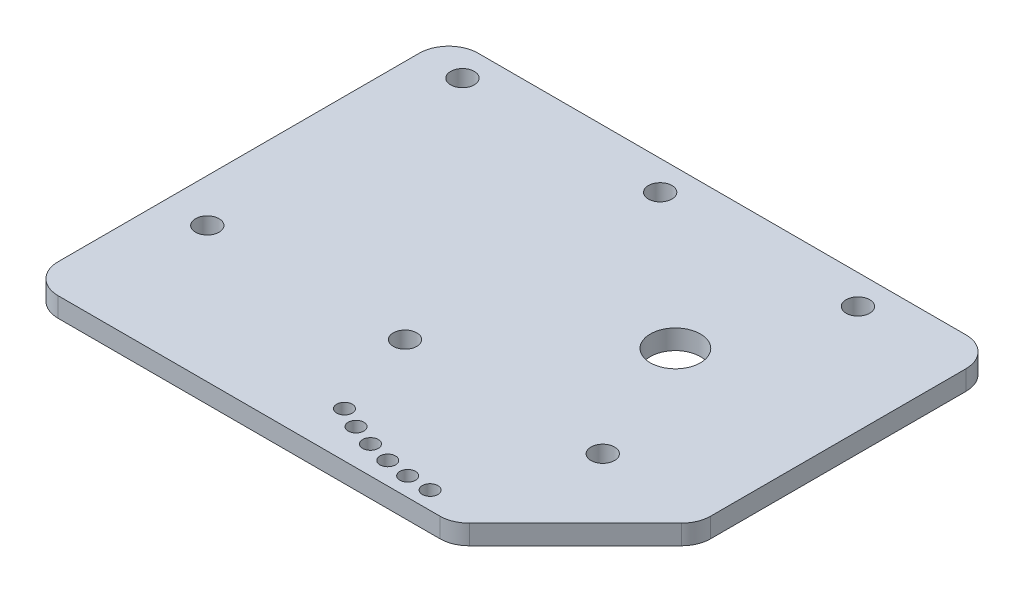
ISO-10303-21;
HEADER;
FILE_DESCRIPTION(('STEP AP214'),'2;1');
FILE_NAME('part.step','',(''),(''),'','','');
FILE_SCHEMA(('AUTOMOTIVE_DESIGN { 1 0 10303 214 1 1 1 1 }'));
ENDSEC;
DATA;
#1=APPLICATION_CONTEXT('core data for automotive mechanical design processes');
#2=APPLICATION_PROTOCOL_DEFINITION('international standard','automotive_design',2000,#1);
#3=PRODUCT_CONTEXT('',#1,'mechanical');
#4=PRODUCT('Part','Part','',(#3));
#5=PRODUCT_RELATED_PRODUCT_CATEGORY('part','',(#4));
#6=PRODUCT_DEFINITION_FORMATION('','',#4);
#7=PRODUCT_DEFINITION_CONTEXT('part definition',#1,'design');
#8=PRODUCT_DEFINITION('design','',#6,#7);
#9=PRODUCT_DEFINITION_SHAPE('','',#8);
#10=(LENGTH_UNIT() NAMED_UNIT(*) SI_UNIT(.MILLI.,.METRE.));
#11=(NAMED_UNIT(*) PLANE_ANGLE_UNIT() SI_UNIT($,.RADIAN.));
#12=(NAMED_UNIT(*) SI_UNIT($,.STERADIAN.) SOLID_ANGLE_UNIT());
#13=UNCERTAINTY_MEASURE_WITH_UNIT(LENGTH_MEASURE(1.E-05),#10,'distance_accuracy_value','');
#14=(GEOMETRIC_REPRESENTATION_CONTEXT(3) GLOBAL_UNCERTAINTY_ASSIGNED_CONTEXT((#13)) GLOBAL_UNIT_ASSIGNED_CONTEXT((#10,
#11,#12)) REPRESENTATION_CONTEXT('',''));
#15=CARTESIAN_POINT('',(0.,0.,0.));
#16=DIRECTION('',(0.,0.,1.));
#17=DIRECTION('',(1.,0.,0.));
#18=AXIS2_PLACEMENT_3D('',#15,#16,#17);
#19=CARTESIAN_POINT('',(-180.5,10.,119.));
#20=DIRECTION('',(0.,-1.,0.));
#21=DIRECTION('',(0.,0.,-1.));
#22=AXIS2_PLACEMENT_3D('',#19,#20,#21);
#23=CYLINDRICAL_SURFACE('',#22,15.);
#24=CARTESIAN_POINT('',(-180.5,0.,119.));
#25=DIRECTION('',(0.,1.,0.));
#26=DIRECTION('',(0.,0.,1.));
#27=AXIS2_PLACEMENT_3D('',#24,#25,#26);
#28=CIRCLE('',#27,15.);
#29=CARTESIAN_POINT('',(-195.5,0.,119.));
#30=VERTEX_POINT('',#29);
#31=CARTESIAN_POINT('',(-180.5,0.,134.));
#32=VERTEX_POINT('',#31);
#33=EDGE_CURVE('E144',#30,#32,#28,.T.);
#34=ORIENTED_EDGE('',*,*,#33,.T.);
#35=DIRECTION('',(0.,-1.,0.));
#36=VECTOR('',#35,1.);
#37=CARTESIAN_POINT('',(-180.5,10.,134.));
#38=LINE('',#37,#36);
#39=CARTESIAN_POINT('',(-180.5,10.,134.));
#40=VERTEX_POINT('',#39);
#41=EDGE_CURVE('E11',#40,#32,#38,.T.);
#42=ORIENTED_EDGE('',*,*,#41,.F.);
#43=CARTESIAN_POINT('',(-180.5,10.,119.));
#44=DIRECTION('',(0.,1.,0.));
#45=DIRECTION('',(0.,0.,1.));
#46=AXIS2_PLACEMENT_3D('',#43,#44,#45);
#47=CIRCLE('',#46,15.);
#48=CARTESIAN_POINT('',(-195.5,10.,119.));
#49=VERTEX_POINT('',#48);
#50=EDGE_CURVE('E163',#49,#40,#47,.T.);
#51=ORIENTED_EDGE('',*,*,#50,.F.);
#52=DIRECTION('',(0.,-1.,0.));
#53=VECTOR('',#52,1.);
#54=CARTESIAN_POINT('',(-195.5,10.,119.));
#55=LINE('',#54,#53);
#56=EDGE_CURVE('E140',#49,#30,#55,.T.);
#57=ORIENTED_EDGE('',*,*,#56,.T.);
#58=EDGE_LOOP('',(#34,#42,#51,#57));
#59=FACE_BOUND('',#58,.T.);
#60=ADVANCED_FACE('F36',(#59),#23,.T.);
#61=CARTESIAN_POINT('',(-180.5,10.,134.));
#62=DIRECTION('',(0.,0.,-1.));
#63=DIRECTION('',(-1.,0.,0.));
#64=AXIS2_PLACEMENT_3D('',#61,#62,#63);
#65=PLANE('',#64);
#66=DIRECTION('',(1.,0.,0.));
#67=VECTOR('',#66,1.);
#68=CARTESIAN_POINT('',(-180.5,0.,134.));
#69=LINE('',#68,#67);
#70=CARTESIAN_POINT('',(13.9999999999998,0.,134.));
#71=VERTEX_POINT('',#70);
#72=EDGE_CURVE('E147',#32,#71,#69,.T.);
#73=ORIENTED_EDGE('',*,*,#72,.T.);
#74=DIRECTION('',(0.,-1.,0.));
#75=VECTOR('',#74,1.);
#76=CARTESIAN_POINT('',(13.9999999999998,10.,134.));
#77=LINE('',#76,#75);
#78=CARTESIAN_POINT('',(13.9999999999998,10.,134.));
#79=VERTEX_POINT('',#78);
#80=EDGE_CURVE('E44',#79,#71,#77,.T.);
#81=ORIENTED_EDGE('',*,*,#80,.F.);
#82=DIRECTION('',(1.,0.,0.));
#83=VECTOR('',#82,1.);
#84=CARTESIAN_POINT('',(-180.5,10.,134.));
#85=LINE('',#84,#83);
#86=EDGE_CURVE('E101',#40,#79,#85,.T.);
#87=ORIENTED_EDGE('',*,*,#86,.F.);
#88=ORIENTED_EDGE('',*,*,#41,.T.);
#89=EDGE_LOOP('',(#73,#81,#87,#88));
#90=FACE_BOUND('',#89,.T.);
#91=ADVANCED_FACE('F334',(#90),#65,.F.);
#92=CARTESIAN_POINT('',(13.9999999999998,10.,119.));
#93=DIRECTION('',(0.,-1.,0.));
#94=DIRECTION('',(0.,0.,-1.));
#95=AXIS2_PLACEMENT_3D('',#92,#93,#94);
#96=CYLINDRICAL_SURFACE('',#95,15.);
#97=CARTESIAN_POINT('',(13.9999999999998,0.,119.));
#98=DIRECTION('',(0.,1.,0.));
#99=DIRECTION('',(0.,0.,1.));
#100=AXIS2_PLACEMENT_3D('',#97,#98,#99);
#101=CIRCLE('',#100,15.);
#102=CARTESIAN_POINT('',(24.606601717798,0.,129.606601717798));
#103=VERTEX_POINT('',#102);
#104=EDGE_CURVE('E150',#71,#103,#101,.T.);
#105=ORIENTED_EDGE('',*,*,#104,.T.);
#106=DIRECTION('',(0.,-1.,0.));
#107=VECTOR('',#106,1.);
#108=CARTESIAN_POINT('',(24.606601717798,10.,129.606601717798));
#109=LINE('',#108,#107);
#110=CARTESIAN_POINT('',(24.606601717798,10.,129.606601717798));
#111=VERTEX_POINT('',#110);
#112=EDGE_CURVE('E176',#111,#103,#109,.T.);
#113=ORIENTED_EDGE('',*,*,#112,.F.);
#114=CARTESIAN_POINT('',(13.9999999999998,10.,119.));
#115=DIRECTION('',(0.,1.,0.));
#116=DIRECTION('',(0.,0.,1.));
#117=AXIS2_PLACEMENT_3D('',#114,#115,#116);
#118=CIRCLE('',#117,15.);
#119=EDGE_CURVE('E184',#79,#111,#118,.T.);
#120=ORIENTED_EDGE('',*,*,#119,.F.);
#121=ORIENTED_EDGE('',*,*,#80,.T.);
#122=EDGE_LOOP('',(#105,#113,#120,#121));
#123=FACE_BOUND('',#122,.T.);
#124=ADVANCED_FACE('F182',(#123),#96,.T.);
#125=CARTESIAN_POINT('',(24.606601717798,10.,129.606601717798));
#126=DIRECTION('',(-0.707106781186546,0.,-0.707106781186549));
#127=DIRECTION('',(-0.707106781186549,0.,0.707106781186546));
#128=AXIS2_PLACEMENT_3D('',#125,#126,#127);
#129=PLANE('',#128);
#130=DIRECTION('',(0.707106781186549,0.,-0.707106781186546));
#131=VECTOR('',#130,1.);
#132=CARTESIAN_POINT('',(24.606601717798,0.,129.606601717798));
#133=LINE('',#132,#131);
#134=CARTESIAN_POINT('',(78.6066017177982,0.,75.6066017177982));
#135=VERTEX_POINT('',#134);
#136=EDGE_CURVE('E152',#103,#135,#133,.T.);
#137=ORIENTED_EDGE('',*,*,#136,.T.);
#138=DIRECTION('',(0.,-1.,0.));
#139=VECTOR('',#138,1.);
#140=CARTESIAN_POINT('',(78.6066017177982,10.,75.6066017177982));
#141=LINE('',#140,#139);
#142=CARTESIAN_POINT('',(78.6066017177982,10.,75.6066017177982));
#143=VERTEX_POINT('',#142);
#144=EDGE_CURVE('E173',#143,#135,#141,.T.);
#145=ORIENTED_EDGE('',*,*,#144,.F.);
#146=DIRECTION('',(0.707106781186549,0.,-0.707106781186546));
#147=VECTOR('',#146,1.);
#148=CARTESIAN_POINT('',(24.606601717798,10.,129.606601717798));
#149=LINE('',#148,#147);
#150=EDGE_CURVE('E202',#111,#143,#149,.T.);
#151=ORIENTED_EDGE('',*,*,#150,.F.);
#152=ORIENTED_EDGE('',*,*,#112,.T.);
#153=EDGE_LOOP('',(#137,#145,#151,#152));
#154=FACE_BOUND('',#153,.T.);
#155=ADVANCED_FACE('F193',(#154),#129,.F.);
#156=CARTESIAN_POINT('',(68.,10.,65.));
#157=DIRECTION('',(0.,-1.,0.));
#158=DIRECTION('',(0.,0.,-1.));
#159=AXIS2_PLACEMENT_3D('',#156,#157,#158);
#160=CYLINDRICAL_SURFACE('',#159,15.);
#161=CARTESIAN_POINT('',(68.,0.,65.));
#162=DIRECTION('',(0.,1.,0.));
#163=DIRECTION('',(0.,0.,1.));
#164=AXIS2_PLACEMENT_3D('',#161,#162,#163);
#165=CIRCLE('',#164,15.);
#166=CARTESIAN_POINT('',(83.,0.,65.));
#167=VERTEX_POINT('',#166);
#168=EDGE_CURVE('E154',#135,#167,#165,.T.);
#169=ORIENTED_EDGE('',*,*,#168,.T.);
#170=DIRECTION('',(0.,-1.,0.));
#171=VECTOR('',#170,1.);
#172=CARTESIAN_POINT('',(83.,10.,65.));
#173=LINE('',#172,#171);
#174=CARTESIAN_POINT('',(83.,10.,65.));
#175=VERTEX_POINT('',#174);
#176=EDGE_CURVE('E170',#175,#167,#173,.T.);
#177=ORIENTED_EDGE('',*,*,#176,.F.);
#178=CARTESIAN_POINT('',(68.,10.,65.));
#179=DIRECTION('',(0.,1.,0.));
#180=DIRECTION('',(0.,0.,1.));
#181=AXIS2_PLACEMENT_3D('',#178,#179,#180);
#182=CIRCLE('',#181,15.);
#183=EDGE_CURVE('E199',#143,#175,#182,.T.);
#184=ORIENTED_EDGE('',*,*,#183,.F.);
#185=ORIENTED_EDGE('',*,*,#144,.T.);
#186=EDGE_LOOP('',(#169,#177,#184,#185));
#187=FACE_BOUND('',#186,.T.);
#188=ADVANCED_FACE('F197',(#187),#160,.T.);
#189=CARTESIAN_POINT('',(83.,10.,65.));
#190=DIRECTION('',(-1.,0.,0.));
#191=DIRECTION('',(0.,0.,1.));
#192=AXIS2_PLACEMENT_3D('',#189,#190,#191);
#193=PLANE('',#192);
#194=DIRECTION('',(0.,0.,-1.));
#195=VECTOR('',#194,1.);
#196=CARTESIAN_POINT('',(83.,0.,65.));
#197=LINE('',#196,#195);
#198=CARTESIAN_POINT('',(83.,0.,-65.));
#199=VERTEX_POINT('',#198);
#200=EDGE_CURVE('E156',#167,#199,#197,.T.);
#201=ORIENTED_EDGE('',*,*,#200,.T.);
#202=DIRECTION('',(0.,-1.,0.));
#203=VECTOR('',#202,1.);
#204=CARTESIAN_POINT('',(83.,10.,-65.));
#205=LINE('',#204,#203);
#206=CARTESIAN_POINT('',(83.,10.,-65.));
#207=VERTEX_POINT('',#206);
#208=EDGE_CURVE('E167',#207,#199,#205,.T.);
#209=ORIENTED_EDGE('',*,*,#208,.F.);
#210=DIRECTION('',(0.,0.,-1.));
#211=VECTOR('',#210,1.);
#212=CARTESIAN_POINT('',(83.,10.,65.));
#213=LINE('',#212,#211);
#214=EDGE_CURVE('E201',#175,#207,#213,.T.);
#215=ORIENTED_EDGE('',*,*,#214,.F.);
#216=ORIENTED_EDGE('',*,*,#176,.T.);
#217=EDGE_LOOP('',(#201,#209,#215,#216));
#218=FACE_BOUND('',#217,.T.);
#219=ADVANCED_FACE('F346',(#218),#193,.F.);
#220=CARTESIAN_POINT('',(68.,10.,-65.));
#221=DIRECTION('',(0.,-1.,0.));
#222=DIRECTION('',(0.,0.,-1.));
#223=AXIS2_PLACEMENT_3D('',#220,#221,#222);
#224=CYLINDRICAL_SURFACE('',#223,15.);
#225=CARTESIAN_POINT('',(68.,0.,-65.));
#226=DIRECTION('',(0.,1.,0.));
#227=DIRECTION('',(0.,0.,1.));
#228=AXIS2_PLACEMENT_3D('',#225,#226,#227);
#229=CIRCLE('',#228,15.);
#230=CARTESIAN_POINT('',(68.,0.,-80.));
#231=VERTEX_POINT('',#230);
#232=EDGE_CURVE('E158',#199,#231,#229,.T.);
#233=ORIENTED_EDGE('',*,*,#232,.T.);
#234=DIRECTION('',(0.,-1.,0.));
#235=VECTOR('',#234,1.);
#236=CARTESIAN_POINT('',(68.,10.,-80.));
#237=LINE('',#236,#235);
#238=CARTESIAN_POINT('',(68.,10.,-80.));
#239=VERTEX_POINT('',#238);
#240=EDGE_CURVE('E135',#239,#231,#237,.T.);
#241=ORIENTED_EDGE('',*,*,#240,.F.);
#242=CARTESIAN_POINT('',(68.,10.,-65.));
#243=DIRECTION('',(0.,1.,0.));
#244=DIRECTION('',(0.,0.,1.));
#245=AXIS2_PLACEMENT_3D('',#242,#243,#244);
#246=CIRCLE('',#245,15.);
#247=EDGE_CURVE('E126',#207,#239,#246,.T.);
#248=ORIENTED_EDGE('',*,*,#247,.F.);
#249=ORIENTED_EDGE('',*,*,#208,.T.);
#250=EDGE_LOOP('',(#233,#241,#248,#249));
#251=FACE_BOUND('',#250,.T.);
#252=ADVANCED_FACE('F343',(#251),#224,.T.);
#253=CARTESIAN_POINT('',(68.,10.,-80.));
#254=DIRECTION('',(0.,0.,1.));
#255=DIRECTION('',(1.,0.,0.));
#256=AXIS2_PLACEMENT_3D('',#253,#254,#255);
#257=PLANE('',#256);
#258=DIRECTION('',(-1.,0.,0.));
#259=VECTOR('',#258,1.);
#260=CARTESIAN_POINT('',(68.,0.,-80.));
#261=LINE('',#260,#259);
#262=CARTESIAN_POINT('',(-180.5,0.,-80.));
#263=VERTEX_POINT('',#262);
#264=EDGE_CURVE('E134',#231,#263,#261,.T.);
#265=ORIENTED_EDGE('',*,*,#264,.T.);
#266=DIRECTION('',(0.,-1.,0.));
#267=VECTOR('',#266,1.);
#268=CARTESIAN_POINT('',(-180.5,10.,-80.));
#269=LINE('',#268,#267);
#270=CARTESIAN_POINT('',(-180.5,10.,-80.));
#271=VERTEX_POINT('',#270);
#272=EDGE_CURVE('E131',#271,#263,#269,.T.);
#273=ORIENTED_EDGE('',*,*,#272,.F.);
#274=DIRECTION('',(-1.,0.,0.));
#275=VECTOR('',#274,1.);
#276=CARTESIAN_POINT('',(68.,10.,-80.));
#277=LINE('',#276,#275);
#278=EDGE_CURVE('E120',#239,#271,#277,.T.);
#279=ORIENTED_EDGE('',*,*,#278,.F.);
#280=ORIENTED_EDGE('',*,*,#240,.T.);
#281=EDGE_LOOP('',(#265,#273,#279,#280));
#282=FACE_BOUND('',#281,.T.);
#283=ADVANCED_FACE('F132',(#282),#257,.F.);
#284=CARTESIAN_POINT('',(-180.5,10.,-65.));
#285=DIRECTION('',(0.,-1.,0.));
#286=DIRECTION('',(0.,0.,-1.));
#287=AXIS2_PLACEMENT_3D('',#284,#285,#286);
#288=CYLINDRICAL_SURFACE('',#287,15.);
#289=CARTESIAN_POINT('',(-180.5,0.,-65.));
#290=DIRECTION('',(0.,1.,0.));
#291=DIRECTION('',(0.,0.,-1.));
#292=AXIS2_PLACEMENT_3D('',#289,#290,#291);
#293=CIRCLE('',#292,15.);
#294=CARTESIAN_POINT('',(-195.5,0.,-65.));
#295=VERTEX_POINT('',#294);
#296=EDGE_CURVE('E87',#263,#295,#293,.T.);
#297=ORIENTED_EDGE('',*,*,#296,.T.);
#298=DIRECTION('',(0.,-1.,0.));
#299=VECTOR('',#298,1.);
#300=CARTESIAN_POINT('',(-195.5,10.,-65.));
#301=LINE('',#300,#299);
#302=CARTESIAN_POINT('',(-195.5,10.,-65.));
#303=VERTEX_POINT('',#302);
#304=EDGE_CURVE('E136',#303,#295,#301,.T.);
#305=ORIENTED_EDGE('',*,*,#304,.F.);
#306=CARTESIAN_POINT('',(-180.5,10.,-65.));
#307=DIRECTION('',(0.,1.,0.));
#308=DIRECTION('',(0.,0.,-1.));
#309=AXIS2_PLACEMENT_3D('',#306,#307,#308);
#310=CIRCLE('',#309,15.);
#311=EDGE_CURVE('E124',#271,#303,#310,.T.);
#312=ORIENTED_EDGE('',*,*,#311,.F.);
#313=ORIENTED_EDGE('',*,*,#272,.T.);
#314=EDGE_LOOP('',(#297,#305,#312,#313));
#315=FACE_BOUND('',#314,.T.);
#316=ADVANCED_FACE('F138',(#315),#288,.T.);
#317=CARTESIAN_POINT('',(-195.5,10.,-65.));
#318=DIRECTION('',(1.,0.,0.));
#319=DIRECTION('',(0.,0.,-1.));
#320=AXIS2_PLACEMENT_3D('',#317,#318,#319);
#321=PLANE('',#320);
#322=DIRECTION('',(0.,0.,1.));
#323=VECTOR('',#322,1.);
#324=CARTESIAN_POINT('',(-195.5,0.,-65.));
#325=LINE('',#324,#323);
#326=EDGE_CURVE('E93',#295,#30,#325,.T.);
#327=ORIENTED_EDGE('',*,*,#326,.T.);
#328=ORIENTED_EDGE('',*,*,#56,.F.);
#329=DIRECTION('',(0.,0.,1.));
#330=VECTOR('',#329,1.);
#331=CARTESIAN_POINT('',(-195.5,10.,-65.));
#332=LINE('',#331,#330);
#333=EDGE_CURVE('E52',#303,#49,#332,.T.);
#334=ORIENTED_EDGE('',*,*,#333,.F.);
#335=ORIENTED_EDGE('',*,*,#304,.T.);
#336=EDGE_LOOP('',(#327,#328,#334,#335));
#337=FACE_BOUND('',#336,.T.);
#338=ADVANCED_FACE('F292',(#337),#321,.F.);
#339=CARTESIAN_POINT('',(-180.5,10.,119.));
#340=DIRECTION('',(0.,1.,0.));
#341=DIRECTION('',(0.,0.,1.));
#342=AXIS2_PLACEMENT_3D('',#339,#340,#341);
#343=PLANE('',#342);
#344=CARTESIAN_POINT('',(0.,10.,125.));
#345=DIRECTION('',(0.,1.,0.));
#346=DIRECTION('',(0.,0.,1.));
#347=AXIS2_PLACEMENT_3D('',#344,#345,#346);
#348=CIRCLE('',#347,3.96875);
#349=CARTESIAN_POINT('',(0.,10.,128.96875));
#350=VERTEX_POINT('',#349);
#351=EDGE_CURVE('E284',#350,#350,#348,.T.);
#352=ORIENTED_EDGE('',*,*,#351,.F.);
#353=EDGE_LOOP('',(#352));
#354=FACE_BOUND('',#353,.T.);
#355=CARTESIAN_POINT('',(-11.9807190650271,10.,124.424524795897));
#356=DIRECTION('',(0.,1.,0.));
#357=DIRECTION('',(0.,0.,1.));
#358=AXIS2_PLACEMENT_3D('',#355,#356,#357);
#359=CIRCLE('',#358,3.96875);
#360=CARTESIAN_POINT('',(-11.9807190650271,10.,128.393274795897));
#361=VERTEX_POINT('',#360);
#362=EDGE_CURVE('E278',#361,#361,#359,.T.);
#363=ORIENTED_EDGE('',*,*,#362,.F.);
#364=EDGE_LOOP('',(#363));
#365=FACE_BOUND('',#364,.T.);
#366=CARTESIAN_POINT('',(-23.8511244220664,10.,122.703397930958));
#367=DIRECTION('',(0.,1.,0.));
#368=DIRECTION('',(0.,0.,1.));
#369=AXIS2_PLACEMENT_3D('',#366,#367,#368);
#370=CIRCLE('',#369,3.96875);
#371=CARTESIAN_POINT('',(-23.8511244220664,10.,126.672147930958));
#372=VERTEX_POINT('',#371);
#373=EDGE_CURVE('E272',#372,#372,#370,.T.);
#374=ORIENTED_EDGE('',*,*,#373,.F.);
#375=EDGE_LOOP('',(#374));
#376=FACE_BOUND('',#375,.T.);
#377=CARTESIAN_POINT('',(-35.5019180879879,10.,119.852466858525));
#378=DIRECTION('',(0.,1.,0.));
#379=DIRECTION('',(0.,0.,1.));
#380=AXIS2_PLACEMENT_3D('',#377,#378,#379);
#381=CIRCLE('',#380,3.96875);
#382=CARTESIAN_POINT('',(-35.5019180879879,10.,123.821216858525));
#383=VERTEX_POINT('',#382);
#384=EDGE_CURVE('E266',#383,#383,#381,.T.);
#385=ORIENTED_EDGE('',*,*,#384,.F.);
#386=EDGE_LOOP('',(#385));
#387=FACE_BOUND('',#386,.T.);
#388=CARTESIAN_POINT('',(-46.8258241769858,10.,115.89798182085));
#389=DIRECTION('',(0.,1.,0.));
#390=DIRECTION('',(0.,0.,1.));
#391=AXIS2_PLACEMENT_3D('',#388,#389,#390);
#392=CIRCLE('',#391,3.96875);
#393=CARTESIAN_POINT('',(-46.8258241769858,10.,119.86673182085));
#394=VERTEX_POINT('',#393);
#395=EDGE_CURVE('E260',#394,#394,#392,.T.);
#396=ORIENTED_EDGE('',*,*,#395,.F.);
#397=EDGE_LOOP('',(#396));
#398=FACE_BOUND('',#397,.T.);
#399=CARTESIAN_POINT('',(-57.7185766543754,10.,110.87635414728));
#400=DIRECTION('',(0.,1.,0.));
#401=DIRECTION('',(0.,0.,1.));
#402=AXIS2_PLACEMENT_3D('',#399,#400,#401);
#403=CIRCLE('',#402,3.96875);
#404=CARTESIAN_POINT('',(-57.7185766543754,10.,114.84510414728));
#405=VERTEX_POINT('',#404);
#406=EDGE_CURVE('E254',#405,#405,#403,.T.);
#407=ORIENTED_EDGE('',*,*,#406,.F.);
#408=EDGE_LOOP('',(#407));
#409=FACE_BOUND('',#408,.T.);
#410=CARTESIAN_POINT('',(0.,10.,0.));
#411=DIRECTION('',(0.,1.,0.));
#412=DIRECTION('',(0.,0.,1.));
#413=AXIS2_PLACEMENT_3D('',#410,#411,#412);
#414=CIRCLE('',#413,12.75);
#415=CARTESIAN_POINT('',(0.,10.,12.75));
#416=VERTEX_POINT('',#415);
#417=EDGE_CURVE('E248',#416,#416,#414,.T.);
#418=ORIENTED_EDGE('',*,*,#417,.F.);
#419=EDGE_LOOP('',(#418));
#420=FACE_BOUND('',#419,.T.);
#421=CARTESIAN_POINT('',(-173.5,10.,-65.));
#422=DIRECTION('',(0.,1.,0.));
#423=DIRECTION('',(0.,0.,1.));
#424=AXIS2_PLACEMENT_3D('',#421,#422,#423);
#425=CIRCLE('',#424,6.00000000000001);
#426=CARTESIAN_POINT('',(-173.5,10.,-59.));
#427=VERTEX_POINT('',#426);
#428=EDGE_CURVE('E242',#427,#427,#425,.T.);
#429=ORIENTED_EDGE('',*,*,#428,.F.);
#430=EDGE_LOOP('',(#429));
#431=FACE_BOUND('',#430,.T.);
#432=CARTESIAN_POINT('',(-72.75,10.,-65.));
#433=DIRECTION('',(0.,1.,0.));
#434=DIRECTION('',(0.,0.,1.));
#435=AXIS2_PLACEMENT_3D('',#432,#433,#434);
#436=CIRCLE('',#435,6.00000000000001);
#437=CARTESIAN_POINT('',(-72.75,10.,-59.));
#438=VERTEX_POINT('',#437);
#439=EDGE_CURVE('E236',#438,#438,#436,.T.);
#440=ORIENTED_EDGE('',*,*,#439,.F.);
#441=EDGE_LOOP('',(#440));
#442=FACE_BOUND('',#441,.T.);
#443=CARTESIAN_POINT('',(-173.5,10.,65.));
#444=DIRECTION('',(0.,1.,0.));
#445=DIRECTION('',(0.,0.,1.));
#446=AXIS2_PLACEMENT_3D('',#443,#444,#445);
#447=CIRCLE('',#446,6.00000000000001);
#448=CARTESIAN_POINT('',(-173.5,10.,71.));
#449=VERTEX_POINT('',#448);
#450=EDGE_CURVE('E230',#449,#449,#447,.T.);
#451=ORIENTED_EDGE('',*,*,#450,.F.);
#452=EDGE_LOOP('',(#451));
#453=FACE_BOUND('',#452,.T.);
#454=CARTESIAN_POINT('',(-72.75,10.,65.));
#455=DIRECTION('',(0.,1.,0.));
#456=DIRECTION('',(0.,0.,1.));
#457=AXIS2_PLACEMENT_3D('',#454,#455,#456);
#458=CIRCLE('',#457,6.00000000000001);
#459=CARTESIAN_POINT('',(-72.75,10.,71.));
#460=VERTEX_POINT('',#459);
#461=EDGE_CURVE('E224',#460,#460,#458,.T.);
#462=ORIENTED_EDGE('',*,*,#461,.F.);
#463=EDGE_LOOP('',(#462));
#464=FACE_BOUND('',#463,.T.);
#465=CARTESIAN_POINT('',(28.,10.,65.));
#466=DIRECTION('',(0.,1.,0.));
#467=DIRECTION('',(0.,0.,1.));
#468=AXIS2_PLACEMENT_3D('',#465,#466,#467);
#469=CIRCLE('',#468,6.);
#470=CARTESIAN_POINT('',(28.,10.,71.));
#471=VERTEX_POINT('',#470);
#472=EDGE_CURVE('E218',#471,#471,#469,.T.);
#473=ORIENTED_EDGE('',*,*,#472,.F.);
#474=EDGE_LOOP('',(#473));
#475=FACE_BOUND('',#474,.T.);
#476=CARTESIAN_POINT('',(28.,10.,-65.));
#477=DIRECTION('',(0.,1.,0.));
#478=DIRECTION('',(0.,0.,1.));
#479=AXIS2_PLACEMENT_3D('',#476,#477,#478);
#480=CIRCLE('',#479,6.);
#481=CARTESIAN_POINT('',(28.,10.,-59.));
#482=VERTEX_POINT('',#481);
#483=EDGE_CURVE('E212',#482,#482,#480,.T.);
#484=ORIENTED_EDGE('',*,*,#483,.F.);
#485=EDGE_LOOP('',(#484));
#486=FACE_BOUND('',#485,.T.);
#487=ORIENTED_EDGE('',*,*,#50,.T.);
#488=ORIENTED_EDGE('',*,*,#86,.T.);
#489=ORIENTED_EDGE('',*,*,#119,.T.);
#490=ORIENTED_EDGE('',*,*,#150,.T.);
#491=ORIENTED_EDGE('',*,*,#183,.T.);
#492=ORIENTED_EDGE('',*,*,#214,.T.);
#493=ORIENTED_EDGE('',*,*,#247,.T.);
#494=ORIENTED_EDGE('',*,*,#278,.T.);
#495=ORIENTED_EDGE('',*,*,#311,.T.);
#496=ORIENTED_EDGE('',*,*,#333,.T.);
#497=EDGE_LOOP('',(#487,#488,#489,#490,#491,#492,#493,#494,#495,#496));
#498=FACE_BOUND('',#497,.T.);
#499=ADVANCED_FACE('F122',(#354,#365,#376,#387,#398,#409,#420,#431,#442,#453,#464,#475,#486,
#498),#343,.T.);
#500=CARTESIAN_POINT('',(-180.5,0.,119.));
#501=DIRECTION('',(0.,1.,0.));
#502=DIRECTION('',(0.,0.,1.));
#503=AXIS2_PLACEMENT_3D('',#500,#501,#502);
#504=PLANE('',#503);
#505=CARTESIAN_POINT('',(0.,0.,125.));
#506=DIRECTION('',(0.,1.,0.));
#507=DIRECTION('',(0.,0.,1.));
#508=AXIS2_PLACEMENT_3D('',#505,#506,#507);
#509=CIRCLE('',#508,3.96875);
#510=CARTESIAN_POINT('',(0.,0.,128.96875));
#511=VERTEX_POINT('',#510);
#512=EDGE_CURVE('E281',#511,#511,#509,.T.);
#513=ORIENTED_EDGE('',*,*,#512,.T.);
#514=EDGE_LOOP('',(#513));
#515=FACE_BOUND('',#514,.T.);
#516=CARTESIAN_POINT('',(-11.9807190650271,0.,124.424524795897));
#517=DIRECTION('',(0.,1.,0.));
#518=DIRECTION('',(0.,0.,1.));
#519=AXIS2_PLACEMENT_3D('',#516,#517,#518);
#520=CIRCLE('',#519,3.96875);
#521=CARTESIAN_POINT('',(-11.9807190650271,0.,128.393274795897));
#522=VERTEX_POINT('',#521);
#523=EDGE_CURVE('E275',#522,#522,#520,.T.);
#524=ORIENTED_EDGE('',*,*,#523,.T.);
#525=EDGE_LOOP('',(#524));
#526=FACE_BOUND('',#525,.T.);
#527=CARTESIAN_POINT('',(-23.8511244220664,0.,122.703397930958));
#528=DIRECTION('',(0.,1.,0.));
#529=DIRECTION('',(0.,0.,1.));
#530=AXIS2_PLACEMENT_3D('',#527,#528,#529);
#531=CIRCLE('',#530,3.96875);
#532=CARTESIAN_POINT('',(-23.8511244220664,0.,126.672147930958));
#533=VERTEX_POINT('',#532);
#534=EDGE_CURVE('E269',#533,#533,#531,.T.);
#535=ORIENTED_EDGE('',*,*,#534,.T.);
#536=EDGE_LOOP('',(#535));
#537=FACE_BOUND('',#536,.T.);
#538=CARTESIAN_POINT('',(-35.5019180879879,0.,119.852466858525));
#539=DIRECTION('',(0.,1.,0.));
#540=DIRECTION('',(0.,0.,1.));
#541=AXIS2_PLACEMENT_3D('',#538,#539,#540);
#542=CIRCLE('',#541,3.96875);
#543=CARTESIAN_POINT('',(-35.5019180879879,0.,123.821216858525));
#544=VERTEX_POINT('',#543);
#545=EDGE_CURVE('E263',#544,#544,#542,.T.);
#546=ORIENTED_EDGE('',*,*,#545,.T.);
#547=EDGE_LOOP('',(#546));
#548=FACE_BOUND('',#547,.T.);
#549=CARTESIAN_POINT('',(-46.8258241769858,0.,115.89798182085));
#550=DIRECTION('',(0.,1.,0.));
#551=DIRECTION('',(0.,0.,1.));
#552=AXIS2_PLACEMENT_3D('',#549,#550,#551);
#553=CIRCLE('',#552,3.96875);
#554=CARTESIAN_POINT('',(-46.8258241769858,0.,119.86673182085));
#555=VERTEX_POINT('',#554);
#556=EDGE_CURVE('E257',#555,#555,#553,.T.);
#557=ORIENTED_EDGE('',*,*,#556,.T.);
#558=EDGE_LOOP('',(#557));
#559=FACE_BOUND('',#558,.T.);
#560=CARTESIAN_POINT('',(-57.7185766543754,0.,110.87635414728));
#561=DIRECTION('',(0.,1.,0.));
#562=DIRECTION('',(0.,0.,1.));
#563=AXIS2_PLACEMENT_3D('',#560,#561,#562);
#564=CIRCLE('',#563,3.96875);
#565=CARTESIAN_POINT('',(-57.7185766543754,0.,114.84510414728));
#566=VERTEX_POINT('',#565);
#567=EDGE_CURVE('E251',#566,#566,#564,.T.);
#568=ORIENTED_EDGE('',*,*,#567,.T.);
#569=EDGE_LOOP('',(#568));
#570=FACE_BOUND('',#569,.T.);
#571=CARTESIAN_POINT('',(0.,0.,0.));
#572=DIRECTION('',(0.,1.,0.));
#573=DIRECTION('',(0.,0.,1.));
#574=AXIS2_PLACEMENT_3D('',#571,#572,#573);
#575=CIRCLE('',#574,12.75);
#576=CARTESIAN_POINT('',(0.,0.,12.75));
#577=VERTEX_POINT('',#576);
#578=EDGE_CURVE('E245',#577,#577,#575,.T.);
#579=ORIENTED_EDGE('',*,*,#578,.T.);
#580=EDGE_LOOP('',(#579));
#581=FACE_BOUND('',#580,.T.);
#582=CARTESIAN_POINT('',(-173.5,0.,-65.));
#583=DIRECTION('',(0.,1.,0.));
#584=DIRECTION('',(0.,0.,1.));
#585=AXIS2_PLACEMENT_3D('',#582,#583,#584);
#586=CIRCLE('',#585,6.00000000000001);
#587=CARTESIAN_POINT('',(-173.5,0.,-59.));
#588=VERTEX_POINT('',#587);
#589=EDGE_CURVE('E239',#588,#588,#586,.T.);
#590=ORIENTED_EDGE('',*,*,#589,.T.);
#591=EDGE_LOOP('',(#590));
#592=FACE_BOUND('',#591,.T.);
#593=CARTESIAN_POINT('',(-72.75,0.,-65.));
#594=DIRECTION('',(0.,1.,0.));
#595=DIRECTION('',(0.,0.,1.));
#596=AXIS2_PLACEMENT_3D('',#593,#594,#595);
#597=CIRCLE('',#596,6.00000000000001);
#598=CARTESIAN_POINT('',(-72.75,0.,-59.));
#599=VERTEX_POINT('',#598);
#600=EDGE_CURVE('E233',#599,#599,#597,.T.);
#601=ORIENTED_EDGE('',*,*,#600,.T.);
#602=EDGE_LOOP('',(#601));
#603=FACE_BOUND('',#602,.T.);
#604=CARTESIAN_POINT('',(-173.5,0.,65.));
#605=DIRECTION('',(0.,1.,0.));
#606=DIRECTION('',(0.,0.,1.));
#607=AXIS2_PLACEMENT_3D('',#604,#605,#606);
#608=CIRCLE('',#607,6.00000000000001);
#609=CARTESIAN_POINT('',(-173.5,0.,71.));
#610=VERTEX_POINT('',#609);
#611=EDGE_CURVE('E227',#610,#610,#608,.T.);
#612=ORIENTED_EDGE('',*,*,#611,.T.);
#613=EDGE_LOOP('',(#612));
#614=FACE_BOUND('',#613,.T.);
#615=CARTESIAN_POINT('',(-72.75,0.,65.));
#616=DIRECTION('',(0.,1.,0.));
#617=DIRECTION('',(0.,0.,1.));
#618=AXIS2_PLACEMENT_3D('',#615,#616,#617);
#619=CIRCLE('',#618,6.00000000000001);
#620=CARTESIAN_POINT('',(-72.75,0.,71.));
#621=VERTEX_POINT('',#620);
#622=EDGE_CURVE('E221',#621,#621,#619,.T.);
#623=ORIENTED_EDGE('',*,*,#622,.T.);
#624=EDGE_LOOP('',(#623));
#625=FACE_BOUND('',#624,.T.);
#626=CARTESIAN_POINT('',(28.,0.,65.));
#627=DIRECTION('',(0.,1.,0.));
#628=DIRECTION('',(0.,0.,1.));
#629=AXIS2_PLACEMENT_3D('',#626,#627,#628);
#630=CIRCLE('',#629,6.);
#631=CARTESIAN_POINT('',(28.,0.,71.));
#632=VERTEX_POINT('',#631);
#633=EDGE_CURVE('E215',#632,#632,#630,.T.);
#634=ORIENTED_EDGE('',*,*,#633,.T.);
#635=EDGE_LOOP('',(#634));
#636=FACE_BOUND('',#635,.T.);
#637=CARTESIAN_POINT('',(28.,0.,-65.));
#638=DIRECTION('',(0.,1.,0.));
#639=DIRECTION('',(0.,0.,1.));
#640=AXIS2_PLACEMENT_3D('',#637,#638,#639);
#641=CIRCLE('',#640,6.);
#642=CARTESIAN_POINT('',(28.,0.,-59.));
#643=VERTEX_POINT('',#642);
#644=EDGE_CURVE('E148',#643,#643,#641,.T.);
#645=ORIENTED_EDGE('',*,*,#644,.T.);
#646=EDGE_LOOP('',(#645));
#647=FACE_BOUND('',#646,.T.);
#648=ORIENTED_EDGE('',*,*,#33,.F.);
#649=ORIENTED_EDGE('',*,*,#326,.F.);
#650=ORIENTED_EDGE('',*,*,#296,.F.);
#651=ORIENTED_EDGE('',*,*,#264,.F.);
#652=ORIENTED_EDGE('',*,*,#232,.F.);
#653=ORIENTED_EDGE('',*,*,#200,.F.);
#654=ORIENTED_EDGE('',*,*,#168,.F.);
#655=ORIENTED_EDGE('',*,*,#136,.F.);
#656=ORIENTED_EDGE('',*,*,#104,.F.);
#657=ORIENTED_EDGE('',*,*,#72,.F.);
#658=EDGE_LOOP('',(#648,#649,#650,#651,#652,#653,#654,#655,#656,#657));
#659=FACE_BOUND('',#658,.T.);
#660=ADVANCED_FACE('F188',(#515,#526,#537,#548,#559,#570,#581,#592,#603,#614,#625,#636,#647,
#659),#504,.F.);
#661=CARTESIAN_POINT('',(28.,10.,-65.));
#662=DIRECTION('',(0.,1.,0.));
#663=DIRECTION('',(0.,0.,1.));
#664=AXIS2_PLACEMENT_3D('',#661,#662,#663);
#665=CYLINDRICAL_SURFACE('',#664,6.);
#666=ORIENTED_EDGE('',*,*,#644,.F.);
#667=EDGE_LOOP('',(#666));
#668=FACE_BOUND('',#667,.T.);
#669=ORIENTED_EDGE('',*,*,#483,.T.);
#670=EDGE_LOOP('',(#669));
#671=FACE_BOUND('',#670,.T.);
#672=ADVANCED_FACE('F318',(#668,#671),#665,.F.);
#673=CARTESIAN_POINT('',(28.,10.,65.));
#674=DIRECTION('',(0.,1.,0.));
#675=DIRECTION('',(0.,0.,1.));
#676=AXIS2_PLACEMENT_3D('',#673,#674,#675);
#677=CYLINDRICAL_SURFACE('',#676,6.);
#678=ORIENTED_EDGE('',*,*,#633,.F.);
#679=EDGE_LOOP('',(#678));
#680=FACE_BOUND('',#679,.T.);
#681=ORIENTED_EDGE('',*,*,#472,.T.);
#682=EDGE_LOOP('',(#681));
#683=FACE_BOUND('',#682,.T.);
#684=ADVANCED_FACE('F320',(#680,#683),#677,.F.);
#685=CARTESIAN_POINT('',(-72.75,10.,65.));
#686=DIRECTION('',(0.,1.,0.));
#687=DIRECTION('',(0.,0.,1.));
#688=AXIS2_PLACEMENT_3D('',#685,#686,#687);
#689=CYLINDRICAL_SURFACE('',#688,6.00000000000001);
#690=ORIENTED_EDGE('',*,*,#622,.F.);
#691=EDGE_LOOP('',(#690));
#692=FACE_BOUND('',#691,.T.);
#693=ORIENTED_EDGE('',*,*,#461,.T.);
#694=EDGE_LOOP('',(#693));
#695=FACE_BOUND('',#694,.T.);
#696=ADVANCED_FACE('F327',(#692,#695),#689,.F.);
#697=CARTESIAN_POINT('',(-173.5,10.,65.));
#698=DIRECTION('',(0.,1.,0.));
#699=DIRECTION('',(0.,0.,1.));
#700=AXIS2_PLACEMENT_3D('',#697,#698,#699);
#701=CYLINDRICAL_SURFACE('',#700,6.00000000000001);
#702=ORIENTED_EDGE('',*,*,#611,.F.);
#703=EDGE_LOOP('',(#702));
#704=FACE_BOUND('',#703,.T.);
#705=ORIENTED_EDGE('',*,*,#450,.T.);
#706=EDGE_LOOP('',(#705));
#707=FACE_BOUND('',#706,.T.);
#708=ADVANCED_FACE('F426',(#704,#707),#701,.F.);
#709=CARTESIAN_POINT('',(-72.75,10.,-65.));
#710=DIRECTION('',(0.,1.,0.));
#711=DIRECTION('',(0.,0.,1.));
#712=AXIS2_PLACEMENT_3D('',#709,#710,#711);
#713=CYLINDRICAL_SURFACE('',#712,6.00000000000001);
#714=ORIENTED_EDGE('',*,*,#600,.F.);
#715=EDGE_LOOP('',(#714));
#716=FACE_BOUND('',#715,.T.);
#717=ORIENTED_EDGE('',*,*,#439,.T.);
#718=EDGE_LOOP('',(#717));
#719=FACE_BOUND('',#718,.T.);
#720=ADVANCED_FACE('F436',(#716,#719),#713,.F.);
#721=CARTESIAN_POINT('',(-173.5,10.,-65.));
#722=DIRECTION('',(0.,1.,0.));
#723=DIRECTION('',(0.,0.,1.));
#724=AXIS2_PLACEMENT_3D('',#721,#722,#723);
#725=CYLINDRICAL_SURFACE('',#724,6.00000000000001);
#726=ORIENTED_EDGE('',*,*,#589,.F.);
#727=EDGE_LOOP('',(#726));
#728=FACE_BOUND('',#727,.T.);
#729=ORIENTED_EDGE('',*,*,#428,.T.);
#730=EDGE_LOOP('',(#729));
#731=FACE_BOUND('',#730,.T.);
#732=ADVANCED_FACE('F446',(#728,#731),#725,.F.);
#733=CARTESIAN_POINT('',(0.,10.,0.));
#734=DIRECTION('',(0.,1.,0.));
#735=DIRECTION('',(0.,0.,1.));
#736=AXIS2_PLACEMENT_3D('',#733,#734,#735);
#737=CYLINDRICAL_SURFACE('',#736,12.75);
#738=ORIENTED_EDGE('',*,*,#578,.F.);
#739=EDGE_LOOP('',(#738));
#740=FACE_BOUND('',#739,.T.);
#741=ORIENTED_EDGE('',*,*,#417,.T.);
#742=EDGE_LOOP('',(#741));
#743=FACE_BOUND('',#742,.T.);
#744=ADVANCED_FACE('F456',(#740,#743),#737,.F.);
#745=CARTESIAN_POINT('',(-57.7185766543754,10.,110.87635414728));
#746=DIRECTION('',(0.,1.,0.));
#747=DIRECTION('',(0.,0.,1.));
#748=AXIS2_PLACEMENT_3D('',#745,#746,#747);
#749=CYLINDRICAL_SURFACE('',#748,3.96875);
#750=ORIENTED_EDGE('',*,*,#567,.F.);
#751=EDGE_LOOP('',(#750));
#752=FACE_BOUND('',#751,.T.);
#753=ORIENTED_EDGE('',*,*,#406,.T.);
#754=EDGE_LOOP('',(#753));
#755=FACE_BOUND('',#754,.T.);
#756=ADVANCED_FACE('F466',(#752,#755),#749,.F.);
#757=CARTESIAN_POINT('',(-46.8258241769858,10.,115.89798182085));
#758=DIRECTION('',(0.,1.,0.));
#759=DIRECTION('',(0.,0.,1.));
#760=AXIS2_PLACEMENT_3D('',#757,#758,#759);
#761=CYLINDRICAL_SURFACE('',#760,3.96875);
#762=ORIENTED_EDGE('',*,*,#556,.F.);
#763=EDGE_LOOP('',(#762));
#764=FACE_BOUND('',#763,.T.);
#765=ORIENTED_EDGE('',*,*,#395,.T.);
#766=EDGE_LOOP('',(#765));
#767=FACE_BOUND('',#766,.T.);
#768=ADVANCED_FACE('F486',(#764,#767),#761,.F.);
#769=CARTESIAN_POINT('',(-35.5019180879879,10.,119.852466858525));
#770=DIRECTION('',(0.,1.,0.));
#771=DIRECTION('',(0.,0.,1.));
#772=AXIS2_PLACEMENT_3D('',#769,#770,#771);
#773=CYLINDRICAL_SURFACE('',#772,3.96875);
#774=ORIENTED_EDGE('',*,*,#545,.F.);
#775=EDGE_LOOP('',(#774));
#776=FACE_BOUND('',#775,.T.);
#777=ORIENTED_EDGE('',*,*,#384,.T.);
#778=EDGE_LOOP('',(#777));
#779=FACE_BOUND('',#778,.T.);
#780=ADVANCED_FACE('F496',(#776,#779),#773,.F.);
#781=CARTESIAN_POINT('',(-23.8511244220664,10.,122.703397930958));
#782=DIRECTION('',(0.,1.,0.));
#783=DIRECTION('',(0.,0.,1.));
#784=AXIS2_PLACEMENT_3D('',#781,#782,#783);
#785=CYLINDRICAL_SURFACE('',#784,3.96875);
#786=ORIENTED_EDGE('',*,*,#534,.F.);
#787=EDGE_LOOP('',(#786));
#788=FACE_BOUND('',#787,.T.);
#789=ORIENTED_EDGE('',*,*,#373,.T.);
#790=EDGE_LOOP('',(#789));
#791=FACE_BOUND('',#790,.T.);
#792=ADVANCED_FACE('F506',(#788,#791),#785,.F.);
#793=CARTESIAN_POINT('',(-11.9807190650271,10.,124.424524795897));
#794=DIRECTION('',(0.,1.,0.));
#795=DIRECTION('',(0.,0.,1.));
#796=AXIS2_PLACEMENT_3D('',#793,#794,#795);
#797=CYLINDRICAL_SURFACE('',#796,3.96875);
#798=ORIENTED_EDGE('',*,*,#523,.F.);
#799=EDGE_LOOP('',(#798));
#800=FACE_BOUND('',#799,.T.);
#801=ORIENTED_EDGE('',*,*,#362,.T.);
#802=EDGE_LOOP('',(#801));
#803=FACE_BOUND('',#802,.T.);
#804=ADVANCED_FACE('F516',(#800,#803),#797,.F.);
#805=CARTESIAN_POINT('',(0.,10.,125.));
#806=DIRECTION('',(0.,1.,0.));
#807=DIRECTION('',(0.,0.,1.));
#808=AXIS2_PLACEMENT_3D('',#805,#806,#807);
#809=CYLINDRICAL_SURFACE('',#808,3.96875);
#810=ORIENTED_EDGE('',*,*,#512,.F.);
#811=EDGE_LOOP('',(#810));
#812=FACE_BOUND('',#811,.T.);
#813=ORIENTED_EDGE('',*,*,#351,.T.);
#814=EDGE_LOOP('',(#813));
#815=FACE_BOUND('',#814,.T.);
#816=ADVANCED_FACE('F288',(#812,#815),#809,.F.);
#817=CLOSED_SHELL('',(#60,#91,#124,#155,#188,#219,#252,#283,#316,#338,#499,#660,#672,#684,#696,
#708,#720,#732,#744,#756,#768,#780,#792,#804,#816));
#818=MANIFOLD_SOLID_BREP('B2',#817);
#819=ADVANCED_BREP_SHAPE_REPRESENTATION('',(#18,#818),#14);
#820=SHAPE_DEFINITION_REPRESENTATION(#9,#819);
ENDSEC;
END-ISO-10303-21;
